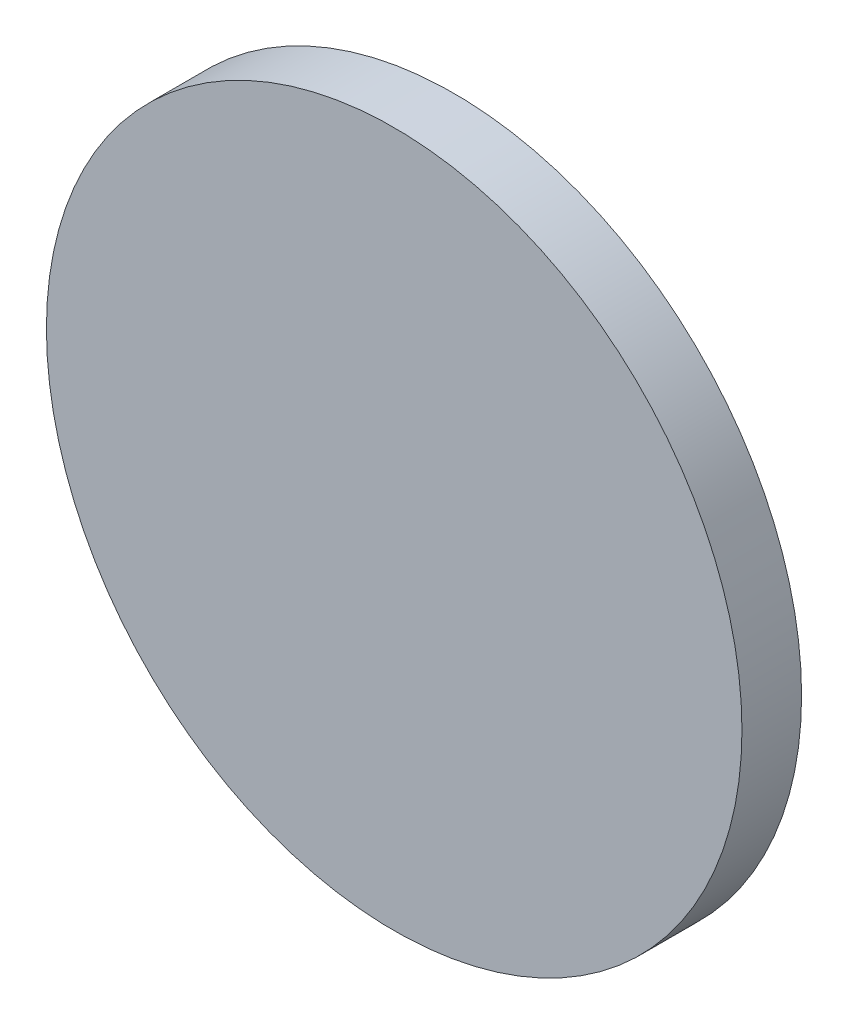
ISO-10303-21;
HEADER;
FILE_DESCRIPTION(('STEP AP214'),'2;1');
FILE_NAME('part.step','',(''),(''),'','','');
FILE_SCHEMA(('AUTOMOTIVE_DESIGN { 1 0 10303 214 1 1 1 1 }'));
ENDSEC;
DATA;
#1=APPLICATION_CONTEXT('core data for automotive mechanical design processes');
#2=APPLICATION_PROTOCOL_DEFINITION('international standard','automotive_design',2000,#1);
#3=PRODUCT_CONTEXT('',#1,'mechanical');
#4=PRODUCT('Part','Part','',(#3));
#5=PRODUCT_RELATED_PRODUCT_CATEGORY('part','',(#4));
#6=PRODUCT_DEFINITION_FORMATION('','',#4);
#7=PRODUCT_DEFINITION_CONTEXT('part definition',#1,'design');
#8=PRODUCT_DEFINITION('design','',#6,#7);
#9=PRODUCT_DEFINITION_SHAPE('','',#8);
#10=(LENGTH_UNIT() NAMED_UNIT(*) SI_UNIT(.MILLI.,.METRE.));
#11=(NAMED_UNIT(*) PLANE_ANGLE_UNIT() SI_UNIT($,.RADIAN.));
#12=(NAMED_UNIT(*) SI_UNIT($,.STERADIAN.) SOLID_ANGLE_UNIT());
#13=UNCERTAINTY_MEASURE_WITH_UNIT(LENGTH_MEASURE(1.E-05),#10,'distance_accuracy_value','');
#14=(GEOMETRIC_REPRESENTATION_CONTEXT(3) GLOBAL_UNCERTAINTY_ASSIGNED_CONTEXT((#13)) GLOBAL_UNIT_ASSIGNED_CONTEXT((#10,
#11,#12)) REPRESENTATION_CONTEXT('',''));
#15=CARTESIAN_POINT('',(0.,0.,0.));
#16=DIRECTION('',(0.,0.,1.));
#17=DIRECTION('',(1.,0.,0.));
#18=AXIS2_PLACEMENT_3D('',#15,#16,#17);
#19=CARTESIAN_POINT('',(1.72974,1.978660006176,0.79916));
#20=DIRECTION('',(0.,0.,1.));
#21=DIRECTION('',(1.,0.,0.));
#22=AXIS2_PLACEMENT_3D('',#19,#20,#21);
#23=PLANE('',#22);
#24=CARTESIAN_POINT('',(1.72974,1.978660006176,0.79916));
#25=DIRECTION('',(0.,0.,1.));
#26=DIRECTION('',(1.,0.,0.));
#27=AXIS2_PLACEMENT_3D('',#24,#25,#26);
#28=CIRCLE('',#27,0.200024667);
#29=CARTESIAN_POINT('',(1.929764667,1.978660006176,0.79916));
#30=VERTEX_POINT('',#29);
#31=EDGE_CURVE('E18',#30,#30,#28,.F.);
#32=ORIENTED_EDGE('',*,*,#31,.F.);
#33=EDGE_LOOP('',(#32));
#34=FACE_BOUND('',#33,.T.);
#35=ADVANCED_FACE('F15',(#34),#23,.T.);
#36=CARTESIAN_POINT('',(1.72974,1.978660006176,0.76487));
#37=DIRECTION('',(0.,0.,1.));
#38=DIRECTION('',(1.,0.,0.));
#39=AXIS2_PLACEMENT_3D('',#36,#37,#38);
#40=CYLINDRICAL_SURFACE('',#39,0.200024667);
#41=ORIENTED_EDGE('',*,*,#31,.T.);
#42=EDGE_LOOP('',(#41));
#43=FACE_BOUND('',#42,.T.);
#44=CARTESIAN_POINT('',(1.72974,1.978660006176,0.76487));
#45=DIRECTION('',(0.,0.,1.));
#46=DIRECTION('',(1.,0.,0.));
#47=AXIS2_PLACEMENT_3D('',#44,#45,#46);
#48=CIRCLE('',#47,0.200024667);
#49=CARTESIAN_POINT('',(1.929764667,1.978660006176,0.76487));
#50=VERTEX_POINT('',#49);
#51=EDGE_CURVE('E10',#50,#50,#48,.F.);
#52=ORIENTED_EDGE('',*,*,#51,.F.);
#53=EDGE_LOOP('',(#52));
#54=FACE_BOUND('',#53,.T.);
#55=ADVANCED_FACE('F27',(#43,#54),#40,.T.);
#56=CARTESIAN_POINT('',(1.72974,1.978660006176,0.76487));
#57=DIRECTION('',(0.,0.,-1.));
#58=DIRECTION('',(-1.,0.,0.));
#59=AXIS2_PLACEMENT_3D('',#56,#57,#58);
#60=PLANE('',#59);
#61=ORIENTED_EDGE('',*,*,#51,.T.);
#62=EDGE_LOOP('',(#61));
#63=FACE_BOUND('',#62,.T.);
#64=ADVANCED_FACE('F35',(#63),#60,.T.);
#65=CLOSED_SHELL('',(#35,#55,#64));
#66=MANIFOLD_SOLID_BREP('B1',#65);
#67=ADVANCED_BREP_SHAPE_REPRESENTATION('',(#18,#66),#14);
#68=SHAPE_DEFINITION_REPRESENTATION(#9,#67);
ENDSEC;
END-ISO-10303-21;
